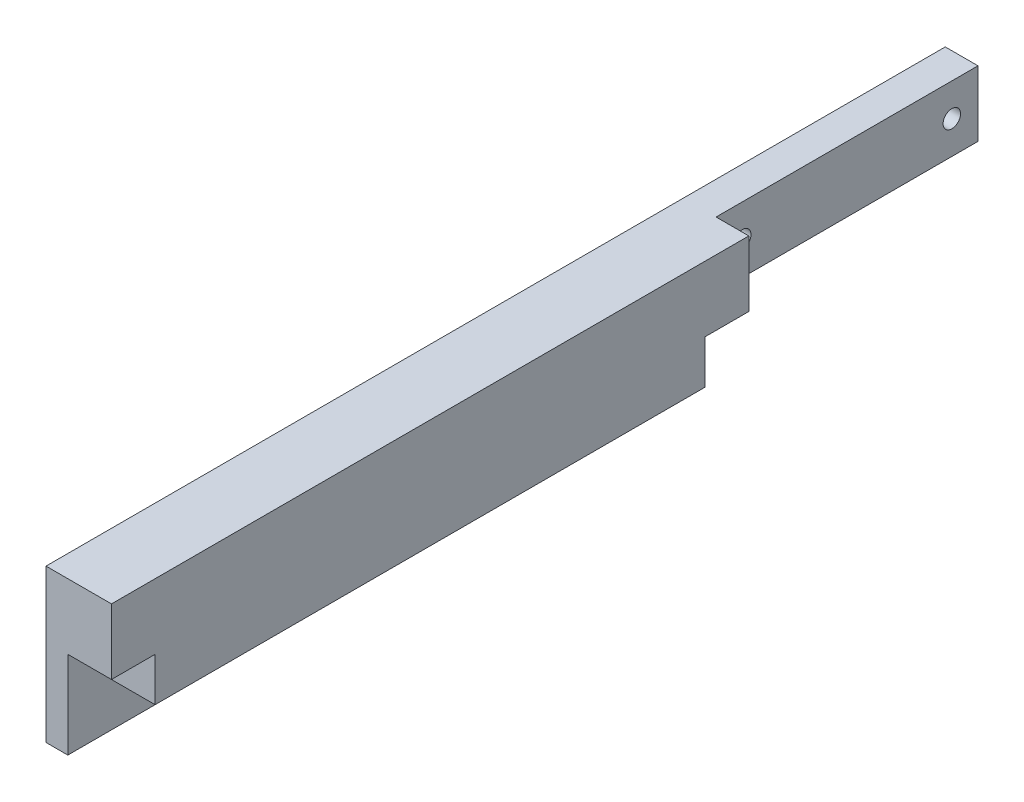
ISO-10303-21;
HEADER;
FILE_DESCRIPTION(('STEP AP214'),'2;1');
FILE_NAME('part.step','',(''),(''),'','','');
FILE_SCHEMA(('AUTOMOTIVE_DESIGN { 1 0 10303 214 1 1 1 1 }'));
ENDSEC;
DATA;
#1=APPLICATION_CONTEXT('core data for automotive mechanical design processes');
#2=APPLICATION_PROTOCOL_DEFINITION('international standard','automotive_design',2000,#1);
#3=PRODUCT_CONTEXT('',#1,'mechanical');
#4=PRODUCT('Part','Part','',(#3));
#5=PRODUCT_RELATED_PRODUCT_CATEGORY('part','',(#4));
#6=PRODUCT_DEFINITION_FORMATION('','',#4);
#7=PRODUCT_DEFINITION_CONTEXT('part definition',#1,'design');
#8=PRODUCT_DEFINITION('design','',#6,#7);
#9=PRODUCT_DEFINITION_SHAPE('','',#8);
#10=(LENGTH_UNIT() NAMED_UNIT(*) SI_UNIT(.MILLI.,.METRE.));
#11=(NAMED_UNIT(*) PLANE_ANGLE_UNIT() SI_UNIT($,.RADIAN.));
#12=(NAMED_UNIT(*) SI_UNIT($,.STERADIAN.) SOLID_ANGLE_UNIT());
#13=UNCERTAINTY_MEASURE_WITH_UNIT(LENGTH_MEASURE(1.E-05),#10,'distance_accuracy_value','');
#14=(GEOMETRIC_REPRESENTATION_CONTEXT(3) GLOBAL_UNCERTAINTY_ASSIGNED_CONTEXT((#13)) GLOBAL_UNIT_ASSIGNED_CONTEXT((#10,
#11,#12)) REPRESENTATION_CONTEXT('',''));
#15=CARTESIAN_POINT('',(0.,0.,0.));
#16=DIRECTION('',(0.,0.,1.));
#17=DIRECTION('',(1.,0.,0.));
#18=AXIS2_PLACEMENT_3D('',#15,#16,#17);
#19=CARTESIAN_POINT('',(2.5,-10.01,-196.));
#20=DIRECTION('',(1.,0.,0.));
#21=DIRECTION('',(0.,0.,-1.));
#22=AXIS2_PLACEMENT_3D('',#19,#20,#21);
#23=PLANE('',#22);
#24=DIRECTION('',(0.,1.,0.));
#25=VECTOR('',#24,1.);
#26=CARTESIAN_POINT('',(2.5,-10.01,-136.));
#27=LINE('',#26,#25);
#28=CARTESIAN_POINT('',(2.5,10.,-136.));
#29=VERTEX_POINT('',#28);
#30=CARTESIAN_POINT('',(2.5,25.,-136.));
#31=VERTEX_POINT('',#30);
#32=EDGE_CURVE('E41',#29,#31,#27,.T.);
#33=ORIENTED_EDGE('',*,*,#32,.F.);
#34=DIRECTION('',(0.,0.,-1.));
#35=VECTOR('',#34,1.);
#36=CARTESIAN_POINT('',(2.5,10.,0.));
#37=LINE('',#36,#35);
#38=CARTESIAN_POINT('',(2.5,10.,-196.));
#39=VERTEX_POINT('',#38);
#40=EDGE_CURVE('E134',#29,#39,#37,.T.);
#41=ORIENTED_EDGE('',*,*,#40,.T.);
#42=DIRECTION('',(0.,1.,0.));
#43=VECTOR('',#42,1.);
#44=CARTESIAN_POINT('',(2.5,-10.01,-196.));
#45=LINE('',#44,#43);
#46=CARTESIAN_POINT('',(2.5,25.,-196.));
#47=VERTEX_POINT('',#46);
#48=EDGE_CURVE('E11',#39,#47,#45,.T.);
#49=ORIENTED_EDGE('',*,*,#48,.T.);
#50=DIRECTION('',(0.,0.,1.));
#51=VECTOR('',#50,1.);
#52=CARTESIAN_POINT('',(2.5,25.,10.));
#53=LINE('',#52,#51);
#54=EDGE_CURVE('E143',#47,#31,#53,.T.);
#55=ORIENTED_EDGE('',*,*,#54,.T.);
#56=EDGE_LOOP('',(#33,#41,#49,#55));
#57=FACE_BOUND('',#56,.T.);
#58=CARTESIAN_POINT('',(2.5,17.5,-142.));
#59=DIRECTION('',(1.,0.,0.));
#60=DIRECTION('',(0.,0.,-1.));
#61=AXIS2_PLACEMENT_3D('',#58,#59,#60);
#62=CIRCLE('',#61,2.);
#63=CARTESIAN_POINT('',(2.5,17.5,-144.));
#64=VERTEX_POINT('',#63);
#65=EDGE_CURVE('E149',#64,#64,#62,.F.);
#66=ORIENTED_EDGE('',*,*,#65,.T.);
#67=EDGE_LOOP('',(#66));
#68=FACE_BOUND('',#67,.T.);
#69=CARTESIAN_POINT('',(2.5,17.5,-190.));
#70=DIRECTION('',(1.,0.,0.));
#71=DIRECTION('',(0.,0.,-1.));
#72=AXIS2_PLACEMENT_3D('',#69,#70,#71);
#73=CIRCLE('',#72,2.);
#74=CARTESIAN_POINT('',(2.5,17.5,-192.));
#75=VERTEX_POINT('',#74);
#76=EDGE_CURVE('E152',#75,#75,#73,.F.);
#77=ORIENTED_EDGE('',*,*,#76,.T.);
#78=EDGE_LOOP('',(#77));
#79=FACE_BOUND('',#78,.T.);
#80=ADVANCED_FACE('F32',(#57,#68,#79),#23,.T.);
#81=CARTESIAN_POINT('',(2.5,-10.01,-136.));
#82=DIRECTION('',(0.,0.,-1.));
#83=DIRECTION('',(-1.,0.,0.));
#84=AXIS2_PLACEMENT_3D('',#81,#82,#83);
#85=PLANE('',#84);
#86=DIRECTION('',(0.,1.,0.));
#87=VECTOR('',#86,1.);
#88=CARTESIAN_POINT('',(10.,0.,-136.));
#89=LINE('',#88,#87);
#90=CARTESIAN_POINT('',(10.,10.,-136.));
#91=VERTEX_POINT('',#90);
#92=CARTESIAN_POINT('',(10.,25.,-136.));
#93=VERTEX_POINT('',#92);
#94=EDGE_CURVE('E128',#91,#93,#89,.T.);
#95=ORIENTED_EDGE('',*,*,#94,.F.);
#96=DIRECTION('',(-1.,0.,0.));
#97=VECTOR('',#96,1.);
#98=CARTESIAN_POINT('',(10.,10.,-136.));
#99=LINE('',#98,#97);
#100=EDGE_CURVE('E131',#91,#29,#99,.T.);
#101=ORIENTED_EDGE('',*,*,#100,.T.);
#102=ORIENTED_EDGE('',*,*,#32,.T.);
#103=DIRECTION('',(1.,0.,0.));
#104=VECTOR('',#103,1.);
#105=CARTESIAN_POINT('',(10.,25.,-136.));
#106=LINE('',#105,#104);
#107=EDGE_CURVE('E140',#31,#93,#106,.T.);
#108=ORIENTED_EDGE('',*,*,#107,.T.);
#109=EDGE_LOOP('',(#95,#101,#102,#108));
#110=FACE_BOUND('',#109,.T.);
#111=ADVANCED_FACE('F275',(#110),#85,.T.);
#112=CARTESIAN_POINT('',(2.5,-10.01,-196.));
#113=DIRECTION('',(0.,0.,-1.));
#114=DIRECTION('',(-1.,0.,0.));
#115=AXIS2_PLACEMENT_3D('',#112,#113,#114);
#116=PLANE('',#115);
#117=ORIENTED_EDGE('',*,*,#48,.F.);
#118=DIRECTION('',(-1.,0.,0.));
#119=VECTOR('',#118,1.);
#120=CARTESIAN_POINT('',(10.,10.,-196.));
#121=LINE('',#120,#119);
#122=CARTESIAN_POINT('',(-5.,10.,-196.));
#123=VERTEX_POINT('',#122);
#124=EDGE_CURVE('E137',#39,#123,#121,.T.);
#125=ORIENTED_EDGE('',*,*,#124,.T.);
#126=DIRECTION('',(0.,-1.,0.));
#127=VECTOR('',#126,1.);
#128=CARTESIAN_POINT('',(-5.,0.,-196.));
#129=LINE('',#128,#127);
#130=CARTESIAN_POINT('',(-5.,25.,-196.));
#131=VERTEX_POINT('',#130);
#132=EDGE_CURVE('E124',#131,#123,#129,.T.);
#133=ORIENTED_EDGE('',*,*,#132,.F.);
#134=DIRECTION('',(1.,0.,0.));
#135=VECTOR('',#134,1.);
#136=CARTESIAN_POINT('',(10.,25.,-196.));
#137=LINE('',#136,#135);
#138=EDGE_CURVE('E146',#131,#47,#137,.T.);
#139=ORIENTED_EDGE('',*,*,#138,.T.);
#140=EDGE_LOOP('',(#117,#125,#133,#139));
#141=FACE_BOUND('',#140,.T.);
#142=ADVANCED_FACE('F269',(#141),#116,.T.);
#143=CARTESIAN_POINT('',(10.,10.,0.));
#144=DIRECTION('',(0.,1.,0.));
#145=DIRECTION('',(0.,0.,1.));
#146=AXIS2_PLACEMENT_3D('',#143,#144,#145);
#147=PLANE('',#146);
#148=ORIENTED_EDGE('',*,*,#100,.F.);
#149=DIRECTION('',(0.,0.,-1.));
#150=VECTOR('',#149,1.);
#151=CARTESIAN_POINT('',(10.,10.,-136.));
#152=LINE('',#151,#150);
#153=CARTESIAN_POINT('',(10.,10.,-126.));
#154=VERTEX_POINT('',#153);
#155=EDGE_CURVE('E158',#154,#91,#152,.T.);
#156=ORIENTED_EDGE('',*,*,#155,.F.);
#157=DIRECTION('',(-1.,0.,0.));
#158=VECTOR('',#157,1.);
#159=CARTESIAN_POINT('',(10.,10.,-126.));
#160=LINE('',#159,#158);
#161=CARTESIAN_POINT('',(0.,10.,-126.));
#162=VERTEX_POINT('',#161);
#163=EDGE_CURVE('E208',#154,#162,#160,.T.);
#164=ORIENTED_EDGE('',*,*,#163,.T.);
#165=DIRECTION('',(0.,0.,1.));
#166=VECTOR('',#165,1.);
#167=CARTESIAN_POINT('',(0.,10.,10.));
#168=LINE('',#167,#166);
#169=CARTESIAN_POINT('',(0.,10.,-136.));
#170=VERTEX_POINT('',#169);
#171=EDGE_CURVE('E49',#170,#162,#168,.T.);
#172=ORIENTED_EDGE('',*,*,#171,.F.);
#173=DIRECTION('',(1.,0.,0.));
#174=VECTOR('',#173,1.);
#175=CARTESIAN_POINT('',(-5.,10.,-136.));
#176=LINE('',#175,#174);
#177=CARTESIAN_POINT('',(-5.,10.,-136.));
#178=VERTEX_POINT('',#177);
#179=EDGE_CURVE('E90',#178,#170,#176,.T.);
#180=ORIENTED_EDGE('',*,*,#179,.F.);
#181=DIRECTION('',(0.,0.,-1.));
#182=VECTOR('',#181,1.);
#183=CARTESIAN_POINT('',(-5.,10.,-136.));
#184=LINE('',#183,#182);
#185=EDGE_CURVE('E36',#178,#123,#184,.T.);
#186=ORIENTED_EDGE('',*,*,#185,.T.);
#187=ORIENTED_EDGE('',*,*,#124,.F.);
#188=ORIENTED_EDGE('',*,*,#40,.F.);
#189=EDGE_LOOP('',(#148,#156,#164,#172,#180,#186,#187,#188));
#190=FACE_BOUND('',#189,.T.);
#191=ADVANCED_FACE('F213',(#190),#147,.F.);
#192=CARTESIAN_POINT('',(10.,25.,10.));
#193=DIRECTION('',(0.,-1.,0.));
#194=DIRECTION('',(0.,0.,-1.));
#195=AXIS2_PLACEMENT_3D('',#192,#193,#194);
#196=PLANE('',#195);
#197=ORIENTED_EDGE('',*,*,#107,.F.);
#198=ORIENTED_EDGE('',*,*,#54,.F.);
#199=ORIENTED_EDGE('',*,*,#138,.F.);
#200=DIRECTION('',(0.,0.,-1.));
#201=VECTOR('',#200,1.);
#202=CARTESIAN_POINT('',(-5.,25.,-136.));
#203=LINE('',#202,#201);
#204=CARTESIAN_POINT('',(-5.,25.,10.));
#205=VERTEX_POINT('',#204);
#206=EDGE_CURVE('E162',#205,#131,#203,.T.);
#207=ORIENTED_EDGE('',*,*,#206,.F.);
#208=DIRECTION('',(-1.,0.,0.));
#209=VECTOR('',#208,1.);
#210=CARTESIAN_POINT('',(10.,25.,10.));
#211=LINE('',#210,#209);
#212=CARTESIAN_POINT('',(10.,25.,10.));
#213=VERTEX_POINT('',#212);
#214=EDGE_CURVE('E214',#213,#205,#211,.T.);
#215=ORIENTED_EDGE('',*,*,#214,.F.);
#216=DIRECTION('',(0.,0.,1.));
#217=VECTOR('',#216,1.);
#218=CARTESIAN_POINT('',(10.,25.,10.));
#219=LINE('',#218,#217);
#220=EDGE_CURVE('E155',#93,#213,#219,.T.);
#221=ORIENTED_EDGE('',*,*,#220,.F.);
#222=EDGE_LOOP('',(#197,#198,#199,#207,#215,#221));
#223=FACE_BOUND('',#222,.T.);
#224=ADVANCED_FACE('F258',(#223),#196,.F.);
#225=CARTESIAN_POINT('',(10.,0.,0.));
#226=DIRECTION('',(1.,0.,0.));
#227=DIRECTION('',(0.,0.,-1.));
#228=AXIS2_PLACEMENT_3D('',#225,#226,#227);
#229=PLANE('',#228);
#230=ORIENTED_EDGE('',*,*,#155,.T.);
#231=ORIENTED_EDGE('',*,*,#94,.T.);
#232=ORIENTED_EDGE('',*,*,#220,.T.);
#233=DIRECTION('',(0.,-1.,0.));
#234=VECTOR('',#233,1.);
#235=CARTESIAN_POINT('',(10.,10.,10.));
#236=LINE('',#235,#234);
#237=CARTESIAN_POINT('',(10.,10.,10.));
#238=VERTEX_POINT('',#237);
#239=EDGE_CURVE('E159',#213,#238,#236,.T.);
#240=ORIENTED_EDGE('',*,*,#239,.T.);
#241=DIRECTION('',(0.,0.,-1.));
#242=VECTOR('',#241,1.);
#243=CARTESIAN_POINT('',(10.,10.,0.));
#244=LINE('',#243,#242);
#245=CARTESIAN_POINT('',(10.,10.,0.));
#246=VERTEX_POINT('',#245);
#247=EDGE_CURVE('E183',#238,#246,#244,.T.);
#248=ORIENTED_EDGE('',*,*,#247,.T.);
#249=DIRECTION('',(0.,-1.,0.));
#250=VECTOR('',#249,1.);
#251=CARTESIAN_POINT('',(10.,0.,0.));
#252=LINE('',#251,#250);
#253=CARTESIAN_POINT('',(10.,0.,0.));
#254=VERTEX_POINT('',#253);
#255=EDGE_CURVE('E194',#246,#254,#252,.T.);
#256=ORIENTED_EDGE('',*,*,#255,.T.);
#257=DIRECTION('',(0.,0.,-1.));
#258=VECTOR('',#257,1.);
#259=CARTESIAN_POINT('',(10.,0.,0.));
#260=LINE('',#259,#258);
#261=CARTESIAN_POINT('',(10.,0.,-126.));
#262=VERTEX_POINT('',#261);
#263=EDGE_CURVE('E191',#254,#262,#260,.T.);
#264=ORIENTED_EDGE('',*,*,#263,.T.);
#265=DIRECTION('',(0.,1.,0.));
#266=VECTOR('',#265,1.);
#267=CARTESIAN_POINT('',(10.,0.,-126.));
#268=LINE('',#267,#266);
#269=EDGE_CURVE('E161',#262,#154,#268,.T.);
#270=ORIENTED_EDGE('',*,*,#269,.T.);
#271=EDGE_LOOP('',(#230,#231,#232,#240,#248,#256,#264,#270));
#272=FACE_BOUND('',#271,.T.);
#273=ADVANCED_FACE('F254',(#272),#229,.T.);
#274=CARTESIAN_POINT('',(-5.,0.,0.));
#275=DIRECTION('',(-1.,0.,0.));
#276=DIRECTION('',(0.,0.,1.));
#277=AXIS2_PLACEMENT_3D('',#274,#275,#276);
#278=PLANE('',#277);
#279=CARTESIAN_POINT('',(-5.,17.5,-190.));
#280=DIRECTION('',(-1.,0.,0.));
#281=DIRECTION('',(0.,0.,1.));
#282=AXIS2_PLACEMENT_3D('',#279,#280,#281);
#283=CIRCLE('',#282,2.);
#284=CARTESIAN_POINT('',(-5.,17.5,-188.));
#285=VERTEX_POINT('',#284);
#286=EDGE_CURVE('E119',#285,#285,#283,.T.);
#287=ORIENTED_EDGE('',*,*,#286,.F.);
#288=EDGE_LOOP('',(#287));
#289=FACE_BOUND('',#288,.T.);
#290=CARTESIAN_POINT('',(-5.,17.5,-142.));
#291=DIRECTION('',(-1.,0.,0.));
#292=DIRECTION('',(0.,0.,1.));
#293=AXIS2_PLACEMENT_3D('',#290,#291,#292);
#294=CIRCLE('',#293,2.);
#295=CARTESIAN_POINT('',(-5.,17.5,-140.));
#296=VERTEX_POINT('',#295);
#297=EDGE_CURVE('E116',#296,#296,#294,.T.);
#298=ORIENTED_EDGE('',*,*,#297,.F.);
#299=EDGE_LOOP('',(#298));
#300=FACE_BOUND('',#299,.T.);
#301=CARTESIAN_POINT('',(-5.,-5.,-15.));
#302=DIRECTION('',(-1.,0.,0.));
#303=DIRECTION('',(0.,0.,1.));
#304=AXIS2_PLACEMENT_3D('',#301,#302,#303);
#305=CIRCLE('',#304,2.);
#306=CARTESIAN_POINT('',(-5.,-5.,-13.));
#307=VERTEX_POINT('',#306);
#308=EDGE_CURVE('E103',#307,#307,#305,.T.);
#309=ORIENTED_EDGE('',*,*,#308,.F.);
#310=EDGE_LOOP('',(#309));
#311=FACE_BOUND('',#310,.T.);
#312=CARTESIAN_POINT('',(-5.,-5.,-111.));
#313=DIRECTION('',(-1.,0.,0.));
#314=DIRECTION('',(0.,0.,1.));
#315=AXIS2_PLACEMENT_3D('',#312,#313,#314);
#316=CIRCLE('',#315,2.00000000000001);
#317=CARTESIAN_POINT('',(-5.,-5.,-109.));
#318=VERTEX_POINT('',#317);
#319=EDGE_CURVE('E106',#318,#318,#316,.T.);
#320=ORIENTED_EDGE('',*,*,#319,.F.);
#321=EDGE_LOOP('',(#320));
#322=FACE_BOUND('',#321,.T.);
#323=ORIENTED_EDGE('',*,*,#206,.T.);
#324=ORIENTED_EDGE('',*,*,#132,.T.);
#325=ORIENTED_EDGE('',*,*,#185,.F.);
#326=DIRECTION('',(0.,-1.,0.));
#327=VECTOR('',#326,1.);
#328=CARTESIAN_POINT('',(-5.,25.,-136.));
#329=LINE('',#328,#327);
#330=CARTESIAN_POINT('',(-5.,-10.,-136.));
#331=VERTEX_POINT('',#330);
#332=EDGE_CURVE('E92',#178,#331,#329,.T.);
#333=ORIENTED_EDGE('',*,*,#332,.T.);
#334=DIRECTION('',(0.,0.,-1.));
#335=VECTOR('',#334,1.);
#336=CARTESIAN_POINT('',(-5.,-10.,10.));
#337=LINE('',#336,#335);
#338=CARTESIAN_POINT('',(-5.,-10.,10.));
#339=VERTEX_POINT('',#338);
#340=EDGE_CURVE('E83',#339,#331,#337,.T.);
#341=ORIENTED_EDGE('',*,*,#340,.F.);
#342=DIRECTION('',(0.,1.,0.));
#343=VECTOR('',#342,1.);
#344=CARTESIAN_POINT('',(-5.,25.,10.));
#345=LINE('',#344,#343);
#346=EDGE_CURVE('E164',#339,#205,#345,.T.);
#347=ORIENTED_EDGE('',*,*,#346,.T.);
#348=EDGE_LOOP('',(#323,#324,#325,#333,#341,#347));
#349=FACE_BOUND('',#348,.T.);
#350=ADVANCED_FACE('F257',(#289,#300,#311,#322,#349),#278,.T.);
#351=CARTESIAN_POINT('',(15.,17.5,-142.));
#352=DIRECTION('',(-1.,0.,0.));
#353=DIRECTION('',(0.,0.,1.));
#354=AXIS2_PLACEMENT_3D('',#351,#352,#353);
#355=CYLINDRICAL_SURFACE('',#354,2.);
#356=ORIENTED_EDGE('',*,*,#297,.T.);
#357=EDGE_LOOP('',(#356));
#358=FACE_BOUND('',#357,.T.);
#359=ORIENTED_EDGE('',*,*,#65,.F.);
#360=EDGE_LOOP('',(#359));
#361=FACE_BOUND('',#360,.T.);
#362=ADVANCED_FACE('F34',(#358,#361),#355,.F.);
#363=CARTESIAN_POINT('',(15.,17.5,-190.));
#364=DIRECTION('',(-1.,0.,0.));
#365=DIRECTION('',(0.,0.,1.));
#366=AXIS2_PLACEMENT_3D('',#363,#364,#365);
#367=CYLINDRICAL_SURFACE('',#366,2.);
#368=ORIENTED_EDGE('',*,*,#286,.T.);
#369=EDGE_LOOP('',(#368));
#370=FACE_BOUND('',#369,.T.);
#371=ORIENTED_EDGE('',*,*,#76,.F.);
#372=EDGE_LOOP('',(#371));
#373=FACE_BOUND('',#372,.T.);
#374=ADVANCED_FACE('F280',(#370,#373),#367,.F.);
#375=CARTESIAN_POINT('',(0.,10.,0.));
#376=VERTEX_POINT('',#375);
#377=CARTESIAN_POINT('',(0.,10.,10.));
#378=VERTEX_POINT('',#377);
#379=EDGE_CURVE('E58',#376,#378,#168,.T.);
#380=ORIENTED_EDGE('',*,*,#379,.F.);
#381=DIRECTION('',(-1.,0.,0.));
#382=VECTOR('',#381,1.);
#383=CARTESIAN_POINT('',(10.,10.,0.));
#384=LINE('',#383,#382);
#385=EDGE_CURVE('E186',#246,#376,#384,.T.);
#386=ORIENTED_EDGE('',*,*,#385,.F.);
#387=ORIENTED_EDGE('',*,*,#247,.F.);
#388=DIRECTION('',(-1.,0.,0.));
#389=VECTOR('',#388,1.);
#390=CARTESIAN_POINT('',(10.,10.,10.));
#391=LINE('',#390,#389);
#392=EDGE_CURVE('E217',#238,#378,#391,.T.);
#393=ORIENTED_EDGE('',*,*,#392,.T.);
#394=EDGE_LOOP('',(#380,#386,#387,#393));
#395=FACE_BOUND('',#394,.T.);
#396=ADVANCED_FACE('F230',(#395),#147,.F.);
#397=CARTESIAN_POINT('',(10.,0.,0.));
#398=DIRECTION('',(0.,0.,-1.));
#399=DIRECTION('',(-1.,0.,0.));
#400=AXIS2_PLACEMENT_3D('',#397,#398,#399);
#401=PLANE('',#400);
#402=DIRECTION('',(0.,-1.,0.));
#403=VECTOR('',#402,1.);
#404=CARTESIAN_POINT('',(0.,0.,0.));
#405=LINE('',#404,#403);
#406=CARTESIAN_POINT('',(0.,0.,0.));
#407=VERTEX_POINT('',#406);
#408=EDGE_CURVE('E165',#376,#407,#405,.T.);
#409=ORIENTED_EDGE('',*,*,#408,.T.);
#410=DIRECTION('',(-1.,0.,0.));
#411=VECTOR('',#410,1.);
#412=CARTESIAN_POINT('',(10.,0.,0.));
#413=LINE('',#412,#411);
#414=EDGE_CURVE('E127',#254,#407,#413,.T.);
#415=ORIENTED_EDGE('',*,*,#414,.F.);
#416=ORIENTED_EDGE('',*,*,#255,.F.);
#417=ORIENTED_EDGE('',*,*,#385,.T.);
#418=EDGE_LOOP('',(#409,#415,#416,#417));
#419=FACE_BOUND('',#418,.T.);
#420=ADVANCED_FACE('F226',(#419),#401,.F.);
#421=CARTESIAN_POINT('',(10.,0.,0.));
#422=DIRECTION('',(0.,1.,0.));
#423=DIRECTION('',(0.,0.,1.));
#424=AXIS2_PLACEMENT_3D('',#421,#422,#423);
#425=PLANE('',#424);
#426=DIRECTION('',(0.,0.,-1.));
#427=VECTOR('',#426,1.);
#428=CARTESIAN_POINT('',(0.,0.,0.));
#429=LINE('',#428,#427);
#430=CARTESIAN_POINT('',(0.,0.,-126.));
#431=VERTEX_POINT('',#430);
#432=EDGE_CURVE('E172',#407,#431,#429,.T.);
#433=ORIENTED_EDGE('',*,*,#432,.T.);
#434=DIRECTION('',(-1.,0.,0.));
#435=VECTOR('',#434,1.);
#436=CARTESIAN_POINT('',(10.,0.,-126.));
#437=LINE('',#436,#435);
#438=EDGE_CURVE('E211',#262,#431,#437,.T.);
#439=ORIENTED_EDGE('',*,*,#438,.F.);
#440=ORIENTED_EDGE('',*,*,#263,.F.);
#441=ORIENTED_EDGE('',*,*,#414,.T.);
#442=EDGE_LOOP('',(#433,#439,#440,#441));
#443=FACE_BOUND('',#442,.T.);
#444=ADVANCED_FACE('F253',(#443),#425,.F.);
#445=CARTESIAN_POINT('',(10.,0.,-126.));
#446=DIRECTION('',(0.,0.,1.));
#447=DIRECTION('',(1.,0.,0.));
#448=AXIS2_PLACEMENT_3D('',#445,#446,#447);
#449=PLANE('',#448);
#450=DIRECTION('',(0.,1.,0.));
#451=VECTOR('',#450,1.);
#452=CARTESIAN_POINT('',(0.,0.,-126.));
#453=LINE('',#452,#451);
#454=EDGE_CURVE('E179',#431,#162,#453,.T.);
#455=ORIENTED_EDGE('',*,*,#454,.T.);
#456=ORIENTED_EDGE('',*,*,#163,.F.);
#457=ORIENTED_EDGE('',*,*,#269,.F.);
#458=ORIENTED_EDGE('',*,*,#438,.T.);
#459=EDGE_LOOP('',(#455,#456,#457,#458));
#460=FACE_BOUND('',#459,.T.);
#461=ADVANCED_FACE('F205',(#460),#449,.F.);
#462=CARTESIAN_POINT('',(10.,25.,-136.));
#463=DIRECTION('',(0.,0.,1.));
#464=DIRECTION('',(1.,0.,0.));
#465=AXIS2_PLACEMENT_3D('',#462,#463,#464);
#466=PLANE('',#465);
#467=ORIENTED_EDGE('',*,*,#332,.F.);
#468=ORIENTED_EDGE('',*,*,#179,.T.);
#469=DIRECTION('',(0.,1.,0.));
#470=VECTOR('',#469,1.);
#471=CARTESIAN_POINT('',(0.,-10.,-136.));
#472=LINE('',#471,#470);
#473=CARTESIAN_POINT('',(0.,-10.,-136.));
#474=VERTEX_POINT('',#473);
#475=EDGE_CURVE('E88',#474,#170,#472,.T.);
#476=ORIENTED_EDGE('',*,*,#475,.F.);
#477=DIRECTION('',(1.,0.,0.));
#478=VECTOR('',#477,1.);
#479=CARTESIAN_POINT('',(-5.,-10.,-136.));
#480=LINE('',#479,#478);
#481=EDGE_CURVE('E76',#331,#474,#480,.T.);
#482=ORIENTED_EDGE('',*,*,#481,.F.);
#483=EDGE_LOOP('',(#467,#468,#476,#482));
#484=FACE_BOUND('',#483,.T.);
#485=ADVANCED_FACE('F89',(#484),#466,.F.);
#486=CARTESIAN_POINT('',(10.,10.,10.));
#487=DIRECTION('',(0.,0.,-1.));
#488=DIRECTION('',(-1.,0.,0.));
#489=AXIS2_PLACEMENT_3D('',#486,#487,#488);
#490=PLANE('',#489);
#491=ORIENTED_EDGE('',*,*,#214,.T.);
#492=ORIENTED_EDGE('',*,*,#346,.F.);
#493=DIRECTION('',(-1.,0.,0.));
#494=VECTOR('',#493,1.);
#495=CARTESIAN_POINT('',(-5.,-10.,10.));
#496=LINE('',#495,#494);
#497=CARTESIAN_POINT('',(0.,-10.,10.));
#498=VERTEX_POINT('',#497);
#499=EDGE_CURVE('E97',#498,#339,#496,.T.);
#500=ORIENTED_EDGE('',*,*,#499,.F.);
#501=DIRECTION('',(0.,1.,0.));
#502=VECTOR('',#501,1.);
#503=CARTESIAN_POINT('',(0.,-10.,10.));
#504=LINE('',#503,#502);
#505=EDGE_CURVE('E91',#498,#378,#504,.T.);
#506=ORIENTED_EDGE('',*,*,#505,.T.);
#507=ORIENTED_EDGE('',*,*,#392,.F.);
#508=ORIENTED_EDGE('',*,*,#239,.F.);
#509=EDGE_LOOP('',(#491,#492,#500,#506,#507,#508));
#510=FACE_BOUND('',#509,.T.);
#511=ADVANCED_FACE('F318',(#510),#490,.F.);
#512=CARTESIAN_POINT('',(0.,-10.,10.));
#513=DIRECTION('',(-1.,0.,0.));
#514=DIRECTION('',(0.,0.,1.));
#515=AXIS2_PLACEMENT_3D('',#512,#513,#514);
#516=PLANE('',#515);
#517=CARTESIAN_POINT('',(0.,-5.,-15.));
#518=DIRECTION('',(1.,0.,0.));
#519=DIRECTION('',(0.,0.,-1.));
#520=AXIS2_PLACEMENT_3D('',#517,#518,#519);
#521=CIRCLE('',#520,2.);
#522=CARTESIAN_POINT('',(0.,-5.,-17.));
#523=VERTEX_POINT('',#522);
#524=EDGE_CURVE('E109',#523,#523,#521,.T.);
#525=ORIENTED_EDGE('',*,*,#524,.F.);
#526=EDGE_LOOP('',(#525));
#527=FACE_BOUND('',#526,.T.);
#528=CARTESIAN_POINT('',(0.,-5.,-111.));
#529=DIRECTION('',(1.,0.,0.));
#530=DIRECTION('',(0.,0.,1.));
#531=AXIS2_PLACEMENT_3D('',#528,#529,#530);
#532=CIRCLE('',#531,2.00000000000001);
#533=CARTESIAN_POINT('',(0.,-5.,-109.));
#534=VERTEX_POINT('',#533);
#535=EDGE_CURVE('E110',#534,#534,#532,.T.);
#536=ORIENTED_EDGE('',*,*,#535,.F.);
#537=EDGE_LOOP('',(#536));
#538=FACE_BOUND('',#537,.T.);
#539=ORIENTED_EDGE('',*,*,#432,.F.);
#540=ORIENTED_EDGE('',*,*,#408,.F.);
#541=ORIENTED_EDGE('',*,*,#379,.T.);
#542=ORIENTED_EDGE('',*,*,#505,.F.);
#543=DIRECTION('',(0.,0.,1.));
#544=VECTOR('',#543,1.);
#545=CARTESIAN_POINT('',(0.,-10.,10.));
#546=LINE('',#545,#544);
#547=EDGE_CURVE('E81',#474,#498,#546,.T.);
#548=ORIENTED_EDGE('',*,*,#547,.F.);
#549=ORIENTED_EDGE('',*,*,#475,.T.);
#550=ORIENTED_EDGE('',*,*,#171,.T.);
#551=ORIENTED_EDGE('',*,*,#454,.F.);
#552=EDGE_LOOP('',(#539,#540,#541,#542,#548,#549,#550,#551));
#553=FACE_BOUND('',#552,.T.);
#554=ADVANCED_FACE('F95',(#527,#538,#553),#516,.F.);
#555=CARTESIAN_POINT('',(0.,-10.,0.));
#556=DIRECTION('',(0.,-1.,0.));
#557=DIRECTION('',(0.,0.,-1.));
#558=AXIS2_PLACEMENT_3D('',#555,#556,#557);
#559=PLANE('',#558);
#560=ORIENTED_EDGE('',*,*,#340,.T.);
#561=ORIENTED_EDGE('',*,*,#481,.T.);
#562=ORIENTED_EDGE('',*,*,#547,.T.);
#563=ORIENTED_EDGE('',*,*,#499,.T.);
#564=EDGE_LOOP('',(#560,#561,#562,#563));
#565=FACE_BOUND('',#564,.T.);
#566=ADVANCED_FACE('F78',(#565),#559,.T.);
#567=CARTESIAN_POINT('',(-20.,-5.,-111.));
#568=DIRECTION('',(1.,0.,0.));
#569=DIRECTION('',(0.,0.,-1.));
#570=AXIS2_PLACEMENT_3D('',#567,#568,#569);
#571=CYLINDRICAL_SURFACE('',#570,2.00000000000001);
#572=ORIENTED_EDGE('',*,*,#319,.T.);
#573=EDGE_LOOP('',(#572));
#574=FACE_BOUND('',#573,.T.);
#575=ORIENTED_EDGE('',*,*,#535,.T.);
#576=EDGE_LOOP('',(#575));
#577=FACE_BOUND('',#576,.T.);
#578=ADVANCED_FACE('F309',(#574,#577),#571,.F.);
#579=CARTESIAN_POINT('',(-20.,-5.,-15.));
#580=DIRECTION('',(1.,0.,0.));
#581=DIRECTION('',(0.,0.,-1.));
#582=AXIS2_PLACEMENT_3D('',#579,#580,#581);
#583=CYLINDRICAL_SURFACE('',#582,2.);
#584=ORIENTED_EDGE('',*,*,#308,.T.);
#585=EDGE_LOOP('',(#584));
#586=FACE_BOUND('',#585,.T.);
#587=ORIENTED_EDGE('',*,*,#524,.T.);
#588=EDGE_LOOP('',(#587));
#589=FACE_BOUND('',#588,.T.);
#590=ADVANCED_FACE('F303',(#586,#589),#583,.F.);
#591=CLOSED_SHELL('',(#80,#111,#142,#191,#224,#273,#350,#362,#374,#396,#420,#444,#461,#485,#511,
#554,#566,#578,#590));
#592=MANIFOLD_SOLID_BREP('B2',#591);
#593=ADVANCED_BREP_SHAPE_REPRESENTATION('',(#18,#592),#14);
#594=SHAPE_DEFINITION_REPRESENTATION(#9,#593);
ENDSEC;
END-ISO-10303-21;
